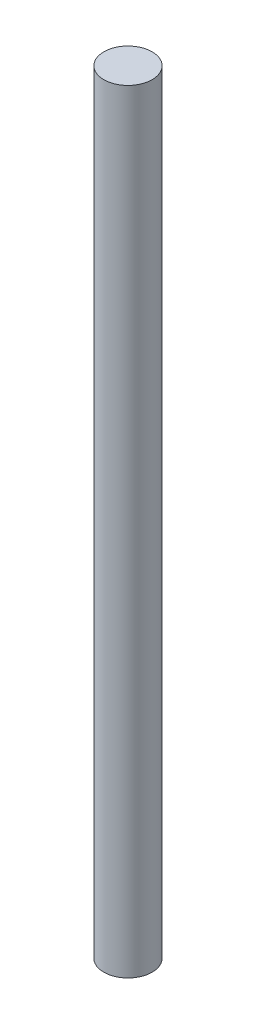
ISO-10303-21;
HEADER;
FILE_DESCRIPTION(('STEP AP214'),'2;1');
FILE_NAME('part.step','',(''),(''),'','','');
FILE_SCHEMA(('AUTOMOTIVE_DESIGN { 1 0 10303 214 1 1 1 1 }'));
ENDSEC;
DATA;
#1=APPLICATION_CONTEXT('core data for automotive mechanical design processes');
#2=APPLICATION_PROTOCOL_DEFINITION('international standard','automotive_design',2000,#1);
#3=PRODUCT_CONTEXT('',#1,'mechanical');
#4=PRODUCT('Part','Part','',(#3));
#5=PRODUCT_RELATED_PRODUCT_CATEGORY('part','',(#4));
#6=PRODUCT_DEFINITION_FORMATION('','',#4);
#7=PRODUCT_DEFINITION_CONTEXT('part definition',#1,'design');
#8=PRODUCT_DEFINITION('design','',#6,#7);
#9=PRODUCT_DEFINITION_SHAPE('','',#8);
#10=(LENGTH_UNIT() NAMED_UNIT(*) SI_UNIT(.MILLI.,.METRE.));
#11=(NAMED_UNIT(*) PLANE_ANGLE_UNIT() SI_UNIT($,.RADIAN.));
#12=(NAMED_UNIT(*) SI_UNIT($,.STERADIAN.) SOLID_ANGLE_UNIT());
#13=UNCERTAINTY_MEASURE_WITH_UNIT(LENGTH_MEASURE(1.E-05),#10,'distance_accuracy_value','');
#14=(GEOMETRIC_REPRESENTATION_CONTEXT(3) GLOBAL_UNCERTAINTY_ASSIGNED_CONTEXT((#13)) GLOBAL_UNIT_ASSIGNED_CONTEXT((#10,
#11,#12)) REPRESENTATION_CONTEXT('',''));
#15=CARTESIAN_POINT('',(0.,0.,0.));
#16=DIRECTION('',(0.,0.,1.));
#17=DIRECTION('',(1.,0.,0.));
#18=AXIS2_PLACEMENT_3D('',#15,#16,#17);
#19=CARTESIAN_POINT('',(0.,203.2,0.));
#20=DIRECTION('',(0.,-1.,0.));
#21=DIRECTION('',(0.,0.,-1.));
#22=AXIS2_PLACEMENT_3D('',#19,#20,#21);
#23=CYLINDRICAL_SURFACE('',#22,6.35);
#24=CARTESIAN_POINT('',(0.,203.2,0.));
#25=DIRECTION('',(0.,1.,0.));
#26=DIRECTION('',(0.,0.,1.));
#27=AXIS2_PLACEMENT_3D('',#24,#25,#26);
#28=CIRCLE('',#27,6.35);
#29=CARTESIAN_POINT('',(0.,203.2,6.35));
#30=VERTEX_POINT('',#29);
#31=EDGE_CURVE('E10',#30,#30,#28,.T.);
#32=ORIENTED_EDGE('',*,*,#31,.F.);
#33=EDGE_LOOP('',(#32));
#34=FACE_BOUND('',#33,.T.);
#35=CARTESIAN_POINT('',(0.,0.,0.));
#36=DIRECTION('',(0.,1.,0.));
#37=DIRECTION('',(0.,0.,1.));
#38=AXIS2_PLACEMENT_3D('',#35,#36,#37);
#39=CIRCLE('',#38,6.35);
#40=CARTESIAN_POINT('',(0.,0.,6.35));
#41=VERTEX_POINT('',#40);
#42=EDGE_CURVE('E34',#41,#41,#39,.T.);
#43=ORIENTED_EDGE('',*,*,#42,.T.);
#44=EDGE_LOOP('',(#43));
#45=FACE_BOUND('',#44,.T.);
#46=ADVANCED_FACE('F31',(#34,#45),#23,.T.);
#47=CARTESIAN_POINT('',(0.,203.2,0.));
#48=DIRECTION('',(0.,1.,0.));
#49=DIRECTION('',(0.,0.,1.));
#50=AXIS2_PLACEMENT_3D('',#47,#48,#49);
#51=PLANE('',#50);
#52=ORIENTED_EDGE('',*,*,#31,.T.);
#53=EDGE_LOOP('',(#52));
#54=FACE_BOUND('',#53,.T.);
#55=ADVANCED_FACE('F46',(#54),#51,.T.);
#56=CARTESIAN_POINT('',(0.,0.,0.));
#57=DIRECTION('',(0.,1.,0.));
#58=DIRECTION('',(0.,0.,1.));
#59=AXIS2_PLACEMENT_3D('',#56,#57,#58);
#60=PLANE('',#59);
#61=ORIENTED_EDGE('',*,*,#42,.F.);
#62=EDGE_LOOP('',(#61));
#63=FACE_BOUND('',#62,.T.);
#64=ADVANCED_FACE('F44',(#63),#60,.F.);
#65=CLOSED_SHELL('',(#46,#55,#64));
#66=MANIFOLD_SOLID_BREP('B2',#65);
#67=ADVANCED_BREP_SHAPE_REPRESENTATION('',(#18,#66),#14);
#68=SHAPE_DEFINITION_REPRESENTATION(#9,#67);
ENDSEC;
END-ISO-10303-21;
